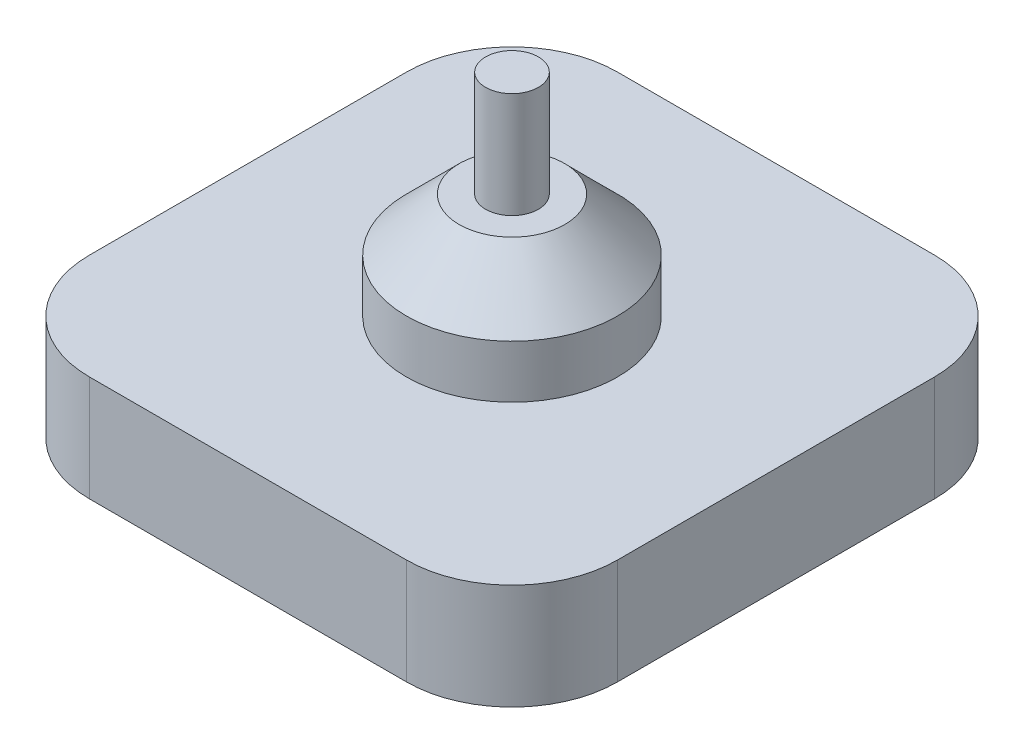
ISO-10303-21;
HEADER;
FILE_DESCRIPTION(('STEP AP214'),'2;1');
FILE_NAME('part.step','',(''),(''),'','','');
FILE_SCHEMA(('AUTOMOTIVE_DESIGN { 1 0 10303 214 1 1 1 1 }'));
ENDSEC;
DATA;
#1=APPLICATION_CONTEXT('core data for automotive mechanical design processes');
#2=APPLICATION_PROTOCOL_DEFINITION('international standard','automotive_design',2000,#1);
#3=PRODUCT_CONTEXT('',#1,'mechanical');
#4=PRODUCT('Part','Part','',(#3));
#5=PRODUCT_RELATED_PRODUCT_CATEGORY('part','',(#4));
#6=PRODUCT_DEFINITION_FORMATION('','',#4);
#7=PRODUCT_DEFINITION_CONTEXT('part definition',#1,'design');
#8=PRODUCT_DEFINITION('design','',#6,#7);
#9=PRODUCT_DEFINITION_SHAPE('','',#8);
#10=(LENGTH_UNIT() NAMED_UNIT(*) SI_UNIT(.MILLI.,.METRE.));
#11=(NAMED_UNIT(*) PLANE_ANGLE_UNIT() SI_UNIT($,.RADIAN.));
#12=(NAMED_UNIT(*) SI_UNIT($,.STERADIAN.) SOLID_ANGLE_UNIT());
#13=UNCERTAINTY_MEASURE_WITH_UNIT(LENGTH_MEASURE(1.E-05),#10,'distance_accuracy_value','');
#14=(GEOMETRIC_REPRESENTATION_CONTEXT(3) GLOBAL_UNCERTAINTY_ASSIGNED_CONTEXT((#13)) GLOBAL_UNIT_ASSIGNED_CONTEXT((#10,
#11,#12)) REPRESENTATION_CONTEXT('',''));
#15=CARTESIAN_POINT('',(0.,0.,0.));
#16=DIRECTION('',(0.,0.,1.));
#17=DIRECTION('',(1.,0.,0.));
#18=AXIS2_PLACEMENT_3D('',#15,#16,#17);
#19=CARTESIAN_POINT('',(250.,100.,-250.));
#20=DIRECTION('',(-1.,0.,0.));
#21=DIRECTION('',(0.,0.,1.));
#22=AXIS2_PLACEMENT_3D('',#19,#20,#21);
#23=PLANE('',#22);
#24=DIRECTION('',(0.,0.,-1.));
#25=VECTOR('',#24,1.);
#26=CARTESIAN_POINT('',(250.,0.,-250.));
#27=LINE('',#26,#25);
#28=CARTESIAN_POINT('',(250.,0.,150.));
#29=VERTEX_POINT('',#28);
#30=CARTESIAN_POINT('',(250.,0.,-150.));
#31=VERTEX_POINT('',#30);
#32=EDGE_CURVE('E133',#29,#31,#27,.T.);
#33=ORIENTED_EDGE('',*,*,#32,.T.);
#34=DIRECTION('',(0.,-1.,0.));
#35=VECTOR('',#34,1.);
#36=CARTESIAN_POINT('',(250.,100.,-150.));
#37=LINE('',#36,#35);
#38=CARTESIAN_POINT('',(250.,100.,-150.));
#39=VERTEX_POINT('',#38);
#40=EDGE_CURVE('E110',#31,#39,#37,.F.);
#41=ORIENTED_EDGE('',*,*,#40,.T.);
#42=DIRECTION('',(0.,0.,-1.));
#43=VECTOR('',#42,1.);
#44=CARTESIAN_POINT('',(250.,100.,-250.));
#45=LINE('',#44,#43);
#46=CARTESIAN_POINT('',(250.,100.,150.));
#47=VERTEX_POINT('',#46);
#48=EDGE_CURVE('E143',#47,#39,#45,.T.);
#49=ORIENTED_EDGE('',*,*,#48,.F.);
#50=DIRECTION('',(0.,-1.,0.));
#51=VECTOR('',#50,1.);
#52=CARTESIAN_POINT('',(250.,100.,150.));
#53=LINE('',#52,#51);
#54=EDGE_CURVE('E115',#47,#29,#53,.T.);
#55=ORIENTED_EDGE('',*,*,#54,.T.);
#56=EDGE_LOOP('',(#33,#41,#49,#55));
#57=FACE_BOUND('',#56,.T.);
#58=ADVANCED_FACE('F38',(#57),#23,.F.);
#59=CARTESIAN_POINT('',(-250.,100.,-250.));
#60=DIRECTION('',(0.,0.,1.));
#61=DIRECTION('',(1.,0.,0.));
#62=AXIS2_PLACEMENT_3D('',#59,#60,#61);
#63=PLANE('',#62);
#64=DIRECTION('',(-1.,0.,0.));
#65=VECTOR('',#64,1.);
#66=CARTESIAN_POINT('',(-250.,100.,-250.));
#67=LINE('',#66,#65);
#68=CARTESIAN_POINT('',(150.,100.,-250.));
#69=VERTEX_POINT('',#68);
#70=CARTESIAN_POINT('',(-150.,100.,-250.));
#71=VERTEX_POINT('',#70);
#72=EDGE_CURVE('E125',#69,#71,#67,.T.);
#73=ORIENTED_EDGE('',*,*,#72,.F.);
#74=DIRECTION('',(0.,-1.,0.));
#75=VECTOR('',#74,1.);
#76=CARTESIAN_POINT('',(150.,100.,-250.));
#77=LINE('',#76,#75);
#78=CARTESIAN_POINT('',(150.,0.,-250.));
#79=VERTEX_POINT('',#78);
#80=EDGE_CURVE('E109',#69,#79,#77,.T.);
#81=ORIENTED_EDGE('',*,*,#80,.T.);
#82=DIRECTION('',(-1.,0.,0.));
#83=VECTOR('',#82,1.);
#84=CARTESIAN_POINT('',(-250.,0.,-250.));
#85=LINE('',#84,#83);
#86=CARTESIAN_POINT('',(-150.,0.,-250.));
#87=VERTEX_POINT('',#86);
#88=EDGE_CURVE('E122',#79,#87,#85,.T.);
#89=ORIENTED_EDGE('',*,*,#88,.T.);
#90=DIRECTION('',(0.,-1.,0.));
#91=VECTOR('',#90,1.);
#92=CARTESIAN_POINT('',(-150.,100.,-250.));
#93=LINE('',#92,#91);
#94=EDGE_CURVE('E127',#87,#71,#93,.F.);
#95=ORIENTED_EDGE('',*,*,#94,.T.);
#96=EDGE_LOOP('',(#73,#81,#89,#95));
#97=FACE_BOUND('',#96,.T.);
#98=ADVANCED_FACE('F121',(#97),#63,.F.);
#99=CARTESIAN_POINT('',(-250.,100.,-250.));
#100=DIRECTION('',(1.,0.,0.));
#101=DIRECTION('',(0.,0.,-1.));
#102=AXIS2_PLACEMENT_3D('',#99,#100,#101);
#103=PLANE('',#102);
#104=DIRECTION('',(0.,0.,1.));
#105=VECTOR('',#104,1.);
#106=CARTESIAN_POINT('',(-250.,100.,-250.));
#107=LINE('',#106,#105);
#108=CARTESIAN_POINT('',(-250.,100.,-150.));
#109=VERTEX_POINT('',#108);
#110=CARTESIAN_POINT('',(-250.,100.,150.));
#111=VERTEX_POINT('',#110);
#112=EDGE_CURVE('E172',#109,#111,#107,.T.);
#113=ORIENTED_EDGE('',*,*,#112,.F.);
#114=DIRECTION('',(0.,-1.,0.));
#115=VECTOR('',#114,1.);
#116=CARTESIAN_POINT('',(-250.,100.,-150.));
#117=LINE('',#116,#115);
#118=CARTESIAN_POINT('',(-250.,0.,-150.));
#119=VERTEX_POINT('',#118);
#120=EDGE_CURVE('E11',#109,#119,#117,.T.);
#121=ORIENTED_EDGE('',*,*,#120,.T.);
#122=DIRECTION('',(0.,0.,1.));
#123=VECTOR('',#122,1.);
#124=CARTESIAN_POINT('',(-250.,0.,-250.));
#125=LINE('',#124,#123);
#126=CARTESIAN_POINT('',(-250.,0.,150.));
#127=VERTEX_POINT('',#126);
#128=EDGE_CURVE('E132',#119,#127,#125,.T.);
#129=ORIENTED_EDGE('',*,*,#128,.T.);
#130=DIRECTION('',(0.,-1.,0.));
#131=VECTOR('',#130,1.);
#132=CARTESIAN_POINT('',(-250.,100.,150.));
#133=LINE('',#132,#131);
#134=EDGE_CURVE('E46',#127,#111,#133,.F.);
#135=ORIENTED_EDGE('',*,*,#134,.T.);
#136=EDGE_LOOP('',(#113,#121,#129,#135));
#137=FACE_BOUND('',#136,.T.);
#138=ADVANCED_FACE('F171',(#137),#103,.F.);
#139=CARTESIAN_POINT('',(-250.,100.,250.));
#140=DIRECTION('',(0.,0.,-1.));
#141=DIRECTION('',(-1.,0.,0.));
#142=AXIS2_PLACEMENT_3D('',#139,#140,#141);
#143=PLANE('',#142);
#144=DIRECTION('',(1.,0.,0.));
#145=VECTOR('',#144,1.);
#146=CARTESIAN_POINT('',(-250.,0.,250.));
#147=LINE('',#146,#145);
#148=CARTESIAN_POINT('',(-150.,0.,250.));
#149=VERTEX_POINT('',#148);
#150=CARTESIAN_POINT('',(150.,0.,250.));
#151=VERTEX_POINT('',#150);
#152=EDGE_CURVE('E136',#149,#151,#147,.T.);
#153=ORIENTED_EDGE('',*,*,#152,.T.);
#154=DIRECTION('',(0.,-1.,0.));
#155=VECTOR('',#154,1.);
#156=CARTESIAN_POINT('',(150.,100.,250.));
#157=LINE('',#156,#155);
#158=CARTESIAN_POINT('',(150.,100.,250.));
#159=VERTEX_POINT('',#158);
#160=EDGE_CURVE('E53',#151,#159,#157,.F.);
#161=ORIENTED_EDGE('',*,*,#160,.T.);
#162=DIRECTION('',(1.,0.,0.));
#163=VECTOR('',#162,1.);
#164=CARTESIAN_POINT('',(-250.,100.,250.));
#165=LINE('',#164,#163);
#166=CARTESIAN_POINT('',(-150.,100.,250.));
#167=VERTEX_POINT('',#166);
#168=EDGE_CURVE('E178',#167,#159,#165,.T.);
#169=ORIENTED_EDGE('',*,*,#168,.F.);
#170=DIRECTION('',(0.,-1.,0.));
#171=VECTOR('',#170,1.);
#172=CARTESIAN_POINT('',(-150.,100.,250.));
#173=LINE('',#172,#171);
#174=EDGE_CURVE('E165',#167,#149,#173,.T.);
#175=ORIENTED_EDGE('',*,*,#174,.T.);
#176=EDGE_LOOP('',(#153,#161,#169,#175));
#177=FACE_BOUND('',#176,.T.);
#178=ADVANCED_FACE('F182',(#177),#143,.F.);
#179=CARTESIAN_POINT('',(0.,100.,0.));
#180=DIRECTION('',(0.,1.,0.));
#181=DIRECTION('',(0.,0.,1.));
#182=AXIS2_PLACEMENT_3D('',#179,#180,#181);
#183=PLANE('',#182);
#184=CARTESIAN_POINT('',(0.,100.,0.));
#185=DIRECTION('',(0.,1.,0.));
#186=DIRECTION('',(0.,0.,1.));
#187=AXIS2_PLACEMENT_3D('',#184,#185,#186);
#188=CIRCLE('',#187,100.);
#189=CARTESIAN_POINT('',(0.,100.,100.));
#190=VERTEX_POINT('',#189);
#191=EDGE_CURVE('E192',#190,#190,#188,.T.);
#192=ORIENTED_EDGE('',*,*,#191,.F.);
#193=EDGE_LOOP('',(#192));
#194=FACE_BOUND('',#193,.T.);
#195=ORIENTED_EDGE('',*,*,#48,.T.);
#196=CARTESIAN_POINT('',(150.,100.,-150.));
#197=DIRECTION('',(0.,1.,0.));
#198=DIRECTION('',(0.,0.,1.));
#199=AXIS2_PLACEMENT_3D('',#196,#197,#198);
#200=CIRCLE('',#199,100.);
#201=EDGE_CURVE('E163',#39,#69,#200,.T.);
#202=ORIENTED_EDGE('',*,*,#201,.T.);
#203=ORIENTED_EDGE('',*,*,#72,.T.);
#204=CARTESIAN_POINT('',(-150.,100.,-150.));
#205=DIRECTION('',(0.,1.,0.));
#206=DIRECTION('',(0.,0.,1.));
#207=AXIS2_PLACEMENT_3D('',#204,#205,#206);
#208=CIRCLE('',#207,100.);
#209=EDGE_CURVE('E159',#71,#109,#208,.T.);
#210=ORIENTED_EDGE('',*,*,#209,.T.);
#211=ORIENTED_EDGE('',*,*,#112,.T.);
#212=CARTESIAN_POINT('',(-150.,100.,150.));
#213=DIRECTION('',(0.,1.,0.));
#214=DIRECTION('',(0.,0.,1.));
#215=AXIS2_PLACEMENT_3D('',#212,#213,#214);
#216=CIRCLE('',#215,100.);
#217=EDGE_CURVE('E60',#111,#167,#216,.T.);
#218=ORIENTED_EDGE('',*,*,#217,.T.);
#219=ORIENTED_EDGE('',*,*,#168,.T.);
#220=CARTESIAN_POINT('',(150.,100.,150.));
#221=DIRECTION('',(0.,1.,0.));
#222=DIRECTION('',(0.,0.,1.));
#223=AXIS2_PLACEMENT_3D('',#220,#221,#222);
#224=CIRCLE('',#223,100.);
#225=EDGE_CURVE('E161',#159,#47,#224,.T.);
#226=ORIENTED_EDGE('',*,*,#225,.T.);
#227=EDGE_LOOP('',(#195,#202,#203,#210,#211,#218,#219,#226));
#228=FACE_BOUND('',#227,.T.);
#229=ADVANCED_FACE('F176',(#194,#228),#183,.T.);
#230=CARTESIAN_POINT('',(0.,0.,0.));
#231=DIRECTION('',(0.,1.,0.));
#232=DIRECTION('',(0.,0.,1.));
#233=AXIS2_PLACEMENT_3D('',#230,#231,#232);
#234=PLANE('',#233);
#235=ORIENTED_EDGE('',*,*,#88,.F.);
#236=CARTESIAN_POINT('',(150.,0.,-150.));
#237=DIRECTION('',(0.,1.,0.));
#238=DIRECTION('',(0.,0.,1.));
#239=AXIS2_PLACEMENT_3D('',#236,#237,#238);
#240=CIRCLE('',#239,100.);
#241=EDGE_CURVE('E105',#79,#31,#240,.F.);
#242=ORIENTED_EDGE('',*,*,#241,.T.);
#243=ORIENTED_EDGE('',*,*,#32,.F.);
#244=CARTESIAN_POINT('',(150.,0.,150.));
#245=DIRECTION('',(0.,1.,0.));
#246=DIRECTION('',(0.,0.,1.));
#247=AXIS2_PLACEMENT_3D('',#244,#245,#246);
#248=CIRCLE('',#247,100.);
#249=EDGE_CURVE('E116',#29,#151,#248,.F.);
#250=ORIENTED_EDGE('',*,*,#249,.T.);
#251=ORIENTED_EDGE('',*,*,#152,.F.);
#252=CARTESIAN_POINT('',(-150.,0.,150.));
#253=DIRECTION('',(0.,1.,0.));
#254=DIRECTION('',(0.,0.,1.));
#255=AXIS2_PLACEMENT_3D('',#252,#253,#254);
#256=CIRCLE('',#255,100.);
#257=EDGE_CURVE('E126',#149,#127,#256,.F.);
#258=ORIENTED_EDGE('',*,*,#257,.T.);
#259=ORIENTED_EDGE('',*,*,#128,.F.);
#260=CARTESIAN_POINT('',(-150.,0.,-150.));
#261=DIRECTION('',(0.,1.,0.));
#262=DIRECTION('',(0.,0.,1.));
#263=AXIS2_PLACEMENT_3D('',#260,#261,#262);
#264=CIRCLE('',#263,100.);
#265=EDGE_CURVE('E131',#119,#87,#264,.F.);
#266=ORIENTED_EDGE('',*,*,#265,.T.);
#267=EDGE_LOOP('',(#235,#242,#243,#250,#251,#258,#259,#266));
#268=FACE_BOUND('',#267,.T.);
#269=ADVANCED_FACE('F129',(#268),#234,.F.);
#270=CARTESIAN_POINT('',(0.,200.,0.));
#271=DIRECTION('',(0.,-1.,0.));
#272=DIRECTION('',(0.,0.,-1.));
#273=AXIS2_PLACEMENT_3D('',#270,#271,#272);
#274=CYLINDRICAL_SURFACE('',#273,100.);
#275=CARTESIAN_POINT('',(0.,150.,0.));
#276=DIRECTION('',(0.,1.,0.));
#277=DIRECTION('',(0.,0.,1.));
#278=AXIS2_PLACEMENT_3D('',#275,#276,#277);
#279=CIRCLE('',#278,100.);
#280=CARTESIAN_POINT('',(0.,150.,100.));
#281=VERTEX_POINT('',#280);
#282=EDGE_CURVE('E147',#281,#281,#279,.F.);
#283=ORIENTED_EDGE('',*,*,#282,.T.);
#284=EDGE_LOOP('',(#283));
#285=FACE_BOUND('',#284,.T.);
#286=ORIENTED_EDGE('',*,*,#191,.T.);
#287=EDGE_LOOP('',(#286));
#288=FACE_BOUND('',#287,.T.);
#289=ADVANCED_FACE('F216',(#285,#288),#274,.T.);
#290=CARTESIAN_POINT('',(0.,200.,0.));
#291=DIRECTION('',(0.,1.,0.));
#292=DIRECTION('',(0.,0.,1.));
#293=AXIS2_PLACEMENT_3D('',#290,#291,#292);
#294=PLANE('',#293);
#295=CARTESIAN_POINT('',(0.,200.,0.));
#296=DIRECTION('',(0.,1.,0.));
#297=DIRECTION('',(0.,0.,1.));
#298=AXIS2_PLACEMENT_3D('',#295,#296,#297);
#299=CIRCLE('',#298,50.);
#300=CARTESIAN_POINT('',(0.,200.,50.));
#301=VERTEX_POINT('',#300);
#302=EDGE_CURVE('E144',#301,#301,#299,.T.);
#303=ORIENTED_EDGE('',*,*,#302,.T.);
#304=EDGE_LOOP('',(#303));
#305=FACE_BOUND('',#304,.T.);
#306=CARTESIAN_POINT('',(0.,200.,0.));
#307=DIRECTION('',(0.,1.,0.));
#308=DIRECTION('',(0.,0.,1.));
#309=AXIS2_PLACEMENT_3D('',#306,#307,#308);
#310=CIRCLE('',#309,25.);
#311=CARTESIAN_POINT('',(0.,200.,25.));
#312=VERTEX_POINT('',#311);
#313=EDGE_CURVE('E148',#312,#312,#310,.T.);
#314=ORIENTED_EDGE('',*,*,#313,.F.);
#315=EDGE_LOOP('',(#314));
#316=FACE_BOUND('',#315,.T.);
#317=ADVANCED_FACE('F208',(#305,#316),#294,.T.);
#318=CARTESIAN_POINT('',(0.,300.,0.));
#319=DIRECTION('',(0.,-1.,0.));
#320=DIRECTION('',(0.,0.,-1.));
#321=AXIS2_PLACEMENT_3D('',#318,#319,#320);
#322=CYLINDRICAL_SURFACE('',#321,25.);
#323=CARTESIAN_POINT('',(0.,300.,0.));
#324=DIRECTION('',(0.,1.,0.));
#325=DIRECTION('',(0.,0.,1.));
#326=AXIS2_PLACEMENT_3D('',#323,#324,#325);
#327=CIRCLE('',#326,25.);
#328=CARTESIAN_POINT('',(0.,300.,25.));
#329=VERTEX_POINT('',#328);
#330=EDGE_CURVE('E138',#329,#329,#327,.T.);
#331=ORIENTED_EDGE('',*,*,#330,.F.);
#332=EDGE_LOOP('',(#331));
#333=FACE_BOUND('',#332,.T.);
#334=ORIENTED_EDGE('',*,*,#313,.T.);
#335=EDGE_LOOP('',(#334));
#336=FACE_BOUND('',#335,.T.);
#337=ADVANCED_FACE('F206',(#333,#336),#322,.T.);
#338=CARTESIAN_POINT('',(0.,300.,0.));
#339=DIRECTION('',(0.,1.,0.));
#340=DIRECTION('',(0.,0.,1.));
#341=AXIS2_PLACEMENT_3D('',#338,#339,#340);
#342=PLANE('',#341);
#343=ORIENTED_EDGE('',*,*,#330,.T.);
#344=EDGE_LOOP('',(#343));
#345=FACE_BOUND('',#344,.T.);
#346=ADVANCED_FACE('F204',(#345),#342,.T.);
#347=CARTESIAN_POINT('',(0.,200.,0.));
#348=DIRECTION('',(0.,-1.,0.));
#349=DIRECTION('',(0.,0.,-1.));
#350=AXIS2_PLACEMENT_3D('',#347,#348,#349);
#351=CONICAL_SURFACE('',#350,50.,0.785398163397447);
#352=ORIENTED_EDGE('',*,*,#282,.F.);
#353=EDGE_LOOP('',(#352));
#354=FACE_BOUND('',#353,.T.);
#355=ORIENTED_EDGE('',*,*,#302,.F.);
#356=EDGE_LOOP('',(#355));
#357=FACE_BOUND('',#356,.T.);
#358=ADVANCED_FACE('F214',(#354,#357),#351,.T.);
#359=CARTESIAN_POINT('',(150.,100.,-150.));
#360=DIRECTION('',(0.,-1.,0.));
#361=DIRECTION('',(0.,0.,-1.));
#362=AXIS2_PLACEMENT_3D('',#359,#360,#361);
#363=CYLINDRICAL_SURFACE('',#362,100.);
#364=ORIENTED_EDGE('',*,*,#201,.F.);
#365=ORIENTED_EDGE('',*,*,#40,.F.);
#366=ORIENTED_EDGE('',*,*,#241,.F.);
#367=ORIENTED_EDGE('',*,*,#80,.F.);
#368=EDGE_LOOP('',(#364,#365,#366,#367));
#369=FACE_BOUND('',#368,.T.);
#370=ADVANCED_FACE('F108',(#369),#363,.T.);
#371=CARTESIAN_POINT('',(150.,100.,150.));
#372=DIRECTION('',(0.,-1.,0.));
#373=DIRECTION('',(0.,0.,-1.));
#374=AXIS2_PLACEMENT_3D('',#371,#372,#373);
#375=CYLINDRICAL_SURFACE('',#374,100.);
#376=ORIENTED_EDGE('',*,*,#225,.F.);
#377=ORIENTED_EDGE('',*,*,#160,.F.);
#378=ORIENTED_EDGE('',*,*,#249,.F.);
#379=ORIENTED_EDGE('',*,*,#54,.F.);
#380=EDGE_LOOP('',(#376,#377,#378,#379));
#381=FACE_BOUND('',#380,.T.);
#382=ADVANCED_FACE('F186',(#381),#375,.T.);
#383=CARTESIAN_POINT('',(-150.,100.,-150.));
#384=DIRECTION('',(0.,-1.,0.));
#385=DIRECTION('',(0.,0.,-1.));
#386=AXIS2_PLACEMENT_3D('',#383,#384,#385);
#387=CYLINDRICAL_SURFACE('',#386,100.);
#388=ORIENTED_EDGE('',*,*,#209,.F.);
#389=ORIENTED_EDGE('',*,*,#94,.F.);
#390=ORIENTED_EDGE('',*,*,#265,.F.);
#391=ORIENTED_EDGE('',*,*,#120,.F.);
#392=EDGE_LOOP('',(#388,#389,#390,#391));
#393=FACE_BOUND('',#392,.T.);
#394=ADVANCED_FACE('F236',(#393),#387,.T.);
#395=CARTESIAN_POINT('',(-150.,100.,150.));
#396=DIRECTION('',(0.,-1.,0.));
#397=DIRECTION('',(0.,0.,-1.));
#398=AXIS2_PLACEMENT_3D('',#395,#396,#397);
#399=CYLINDRICAL_SURFACE('',#398,100.);
#400=ORIENTED_EDGE('',*,*,#217,.F.);
#401=ORIENTED_EDGE('',*,*,#134,.F.);
#402=ORIENTED_EDGE('',*,*,#257,.F.);
#403=ORIENTED_EDGE('',*,*,#174,.F.);
#404=EDGE_LOOP('',(#400,#401,#402,#403));
#405=FACE_BOUND('',#404,.T.);
#406=ADVANCED_FACE('F40',(#405),#399,.T.);
#407=CLOSED_SHELL('',(#58,#98,#138,#178,#229,#269,#289,#317,#337,#346,#358,#370,#382,#394,#406));
#408=MANIFOLD_SOLID_BREP('B2',#407);
#409=ADVANCED_BREP_SHAPE_REPRESENTATION('',(#18,#408),#14);
#410=SHAPE_DEFINITION_REPRESENTATION(#9,#409);
ENDSEC;
END-ISO-10303-21;
